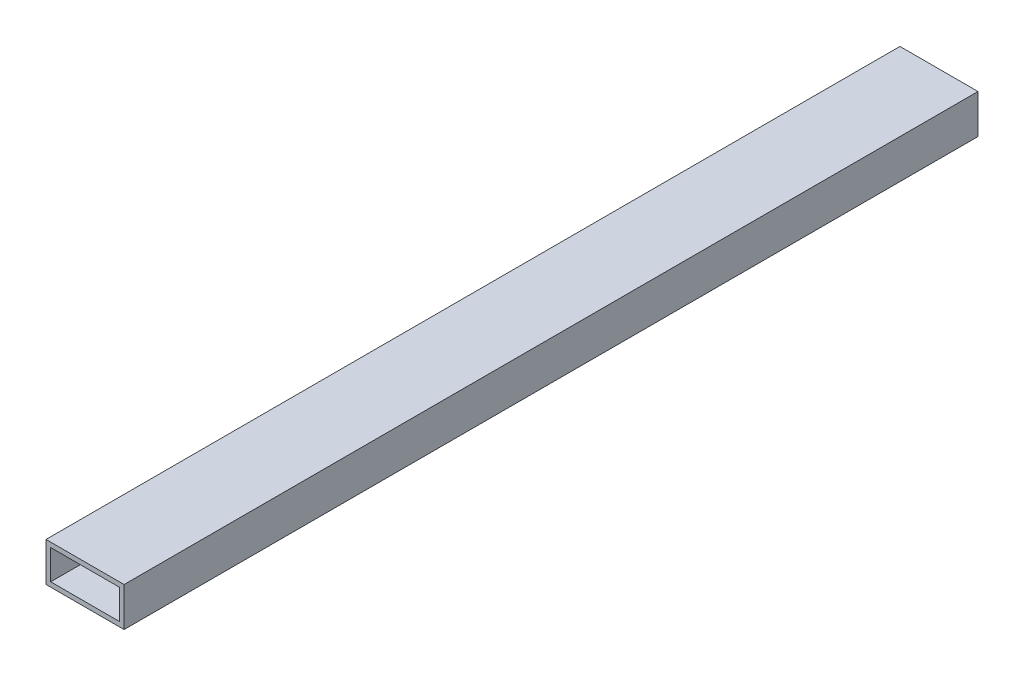
ISO-10303-21;
HEADER;
FILE_DESCRIPTION(('STEP AP214'),'2;1');
FILE_NAME('part.step','',(''),(''),'','','');
FILE_SCHEMA(('AUTOMOTIVE_DESIGN { 1 0 10303 214 1 1 1 1 }'));
ENDSEC;
DATA;
#1=APPLICATION_CONTEXT('core data for automotive mechanical design processes');
#2=APPLICATION_PROTOCOL_DEFINITION('international standard','automotive_design',2000,#1);
#3=PRODUCT_CONTEXT('',#1,'mechanical');
#4=PRODUCT('Part','Part','',(#3));
#5=PRODUCT_RELATED_PRODUCT_CATEGORY('part','',(#4));
#6=PRODUCT_DEFINITION_FORMATION('','',#4);
#7=PRODUCT_DEFINITION_CONTEXT('part definition',#1,'design');
#8=PRODUCT_DEFINITION('design','',#6,#7);
#9=PRODUCT_DEFINITION_SHAPE('','',#8);
#10=(LENGTH_UNIT() NAMED_UNIT(*) SI_UNIT(.MILLI.,.METRE.));
#11=(NAMED_UNIT(*) PLANE_ANGLE_UNIT() SI_UNIT($,.RADIAN.));
#12=(NAMED_UNIT(*) SI_UNIT($,.STERADIAN.) SOLID_ANGLE_UNIT());
#13=UNCERTAINTY_MEASURE_WITH_UNIT(LENGTH_MEASURE(1.E-05),#10,'distance_accuracy_value','');
#14=(GEOMETRIC_REPRESENTATION_CONTEXT(3) GLOBAL_UNCERTAINTY_ASSIGNED_CONTEXT((#13)) GLOBAL_UNIT_ASSIGNED_CONTEXT((#10,
#11,#12)) REPRESENTATION_CONTEXT('',''));
#15=CARTESIAN_POINT('',(0.,0.,0.));
#16=DIRECTION('',(0.,0.,1.));
#17=DIRECTION('',(1.,0.,0.));
#18=AXIS2_PLACEMENT_3D('',#15,#16,#17);
#19=CARTESIAN_POINT('',(0.,0.,558.8));
#20=DIRECTION('',(0.,0.,-1.));
#21=DIRECTION('',(-1.,0.,0.));
#22=AXIS2_PLACEMENT_3D('',#19,#20,#21);
#23=PLANE('',#22);
#24=DIRECTION('',(0.,-1.,0.));
#25=VECTOR('',#24,1.);
#26=CARTESIAN_POINT('',(0.,0.,558.8));
#27=LINE('',#26,#25);
#28=CARTESIAN_POINT('',(0.,25.4,558.8));
#29=VERTEX_POINT('',#28);
#30=CARTESIAN_POINT('',(0.,0.,558.8));
#31=VERTEX_POINT('',#30);
#32=EDGE_CURVE('E157',#29,#31,#27,.T.);
#33=ORIENTED_EDGE('',*,*,#32,.T.);
#34=DIRECTION('',(1.,0.,0.));
#35=VECTOR('',#34,1.);
#36=CARTESIAN_POINT('',(0.,0.,558.8));
#37=LINE('',#36,#35);
#38=CARTESIAN_POINT('',(50.8,0.,558.8));
#39=VERTEX_POINT('',#38);
#40=EDGE_CURVE('E161',#31,#39,#37,.T.);
#41=ORIENTED_EDGE('',*,*,#40,.T.);
#42=DIRECTION('',(0.,1.,0.));
#43=VECTOR('',#42,1.);
#44=CARTESIAN_POINT('',(50.8,0.,558.8));
#45=LINE('',#44,#43);
#46=CARTESIAN_POINT('',(50.8,25.4,558.8));
#47=VERTEX_POINT('',#46);
#48=EDGE_CURVE('E165',#39,#47,#45,.T.);
#49=ORIENTED_EDGE('',*,*,#48,.T.);
#50=DIRECTION('',(-1.,0.,0.));
#51=VECTOR('',#50,1.);
#52=CARTESIAN_POINT('',(0.,25.4,558.8));
#53=LINE('',#52,#51);
#54=EDGE_CURVE('E168',#47,#29,#53,.T.);
#55=ORIENTED_EDGE('',*,*,#54,.T.);
#56=EDGE_LOOP('',(#33,#41,#49,#55));
#57=FACE_BOUND('',#56,.T.);
#58=DIRECTION('',(1.,0.,0.));
#59=VECTOR('',#58,1.);
#60=CARTESIAN_POINT('',(3.048,3.048,558.8));
#61=LINE('',#60,#59);
#62=CARTESIAN_POINT('',(3.048,3.048,558.8));
#63=VERTEX_POINT('',#62);
#64=CARTESIAN_POINT('',(47.752,3.048,558.8));
#65=VERTEX_POINT('',#64);
#66=EDGE_CURVE('E109',#63,#65,#61,.T.);
#67=ORIENTED_EDGE('',*,*,#66,.F.);
#68=DIRECTION('',(0.,-1.,0.));
#69=VECTOR('',#68,1.);
#70=CARTESIAN_POINT('',(3.048,3.048,558.8));
#71=LINE('',#70,#69);
#72=CARTESIAN_POINT('',(3.048,22.352,558.8));
#73=VERTEX_POINT('',#72);
#74=EDGE_CURVE('E135',#73,#63,#71,.T.);
#75=ORIENTED_EDGE('',*,*,#74,.F.);
#76=DIRECTION('',(-1.,0.,0.));
#77=VECTOR('',#76,1.);
#78=CARTESIAN_POINT('',(3.048,22.352,558.8));
#79=LINE('',#78,#77);
#80=CARTESIAN_POINT('',(47.752,22.352,558.8));
#81=VERTEX_POINT('',#80);
#82=EDGE_CURVE('E131',#81,#73,#79,.T.);
#83=ORIENTED_EDGE('',*,*,#82,.F.);
#84=DIRECTION('',(0.,1.,0.));
#85=VECTOR('',#84,1.);
#86=CARTESIAN_POINT('',(47.752,3.048,558.8));
#87=LINE('',#86,#85);
#88=EDGE_CURVE('E118',#65,#81,#87,.T.);
#89=ORIENTED_EDGE('',*,*,#88,.F.);
#90=EDGE_LOOP('',(#67,#75,#83,#89));
#91=FACE_BOUND('',#90,.T.);
#92=ADVANCED_FACE('F43',(#57,#91),#23,.F.);
#93=CARTESIAN_POINT('',(0.,0.,3.175));
#94=DIRECTION('',(0.,0.,-1.));
#95=DIRECTION('',(-1.,0.,0.));
#96=AXIS2_PLACEMENT_3D('',#93,#94,#95);
#97=PLANE('',#96);
#98=DIRECTION('',(0.,-1.,0.));
#99=VECTOR('',#98,1.);
#100=CARTESIAN_POINT('',(0.,0.,3.175));
#101=LINE('',#100,#99);
#102=CARTESIAN_POINT('',(0.,25.4,3.175));
#103=VERTEX_POINT('',#102);
#104=CARTESIAN_POINT('',(0.,0.,3.175));
#105=VERTEX_POINT('',#104);
#106=EDGE_CURVE('E127',#103,#105,#101,.T.);
#107=ORIENTED_EDGE('',*,*,#106,.F.);
#108=DIRECTION('',(-1.,0.,0.));
#109=VECTOR('',#108,1.);
#110=CARTESIAN_POINT('',(0.,25.4,3.175));
#111=LINE('',#110,#109);
#112=CARTESIAN_POINT('',(50.8,25.4,3.175));
#113=VERTEX_POINT('',#112);
#114=EDGE_CURVE('E162',#113,#103,#111,.T.);
#115=ORIENTED_EDGE('',*,*,#114,.F.);
#116=DIRECTION('',(0.,1.,0.));
#117=VECTOR('',#116,1.);
#118=CARTESIAN_POINT('',(50.8,0.,3.175));
#119=LINE('',#118,#117);
#120=CARTESIAN_POINT('',(50.8,0.,3.175));
#121=VERTEX_POINT('',#120);
#122=EDGE_CURVE('E178',#121,#113,#119,.T.);
#123=ORIENTED_EDGE('',*,*,#122,.F.);
#124=DIRECTION('',(1.,0.,0.));
#125=VECTOR('',#124,1.);
#126=CARTESIAN_POINT('',(0.,0.,3.175));
#127=LINE('',#126,#125);
#128=EDGE_CURVE('E175',#105,#121,#127,.T.);
#129=ORIENTED_EDGE('',*,*,#128,.F.);
#130=EDGE_LOOP('',(#107,#115,#123,#129));
#131=FACE_BOUND('',#130,.T.);
#132=DIRECTION('',(0.,-1.,0.));
#133=VECTOR('',#132,1.);
#134=CARTESIAN_POINT('',(3.048,3.048,3.175));
#135=LINE('',#134,#133);
#136=CARTESIAN_POINT('',(3.048,22.352,3.175));
#137=VERTEX_POINT('',#136);
#138=CARTESIAN_POINT('',(3.048,3.048,3.175));
#139=VERTEX_POINT('',#138);
#140=EDGE_CURVE('E119',#137,#139,#135,.T.);
#141=ORIENTED_EDGE('',*,*,#140,.T.);
#142=DIRECTION('',(1.,0.,0.));
#143=VECTOR('',#142,1.);
#144=CARTESIAN_POINT('',(3.048,3.048,3.175));
#145=LINE('',#144,#143);
#146=CARTESIAN_POINT('',(47.752,3.048,3.175));
#147=VERTEX_POINT('',#146);
#148=EDGE_CURVE('E67',#139,#147,#145,.T.);
#149=ORIENTED_EDGE('',*,*,#148,.T.);
#150=DIRECTION('',(0.,1.,0.));
#151=VECTOR('',#150,1.);
#152=CARTESIAN_POINT('',(47.752,3.048,3.175));
#153=LINE('',#152,#151);
#154=CARTESIAN_POINT('',(47.752,22.352,3.175));
#155=VERTEX_POINT('',#154);
#156=EDGE_CURVE('E125',#147,#155,#153,.T.);
#157=ORIENTED_EDGE('',*,*,#156,.T.);
#158=DIRECTION('',(-1.,0.,0.));
#159=VECTOR('',#158,1.);
#160=CARTESIAN_POINT('',(3.048,22.352,3.175));
#161=LINE('',#160,#159);
#162=EDGE_CURVE('E144',#155,#137,#161,.T.);
#163=ORIENTED_EDGE('',*,*,#162,.T.);
#164=EDGE_LOOP('',(#141,#149,#157,#163));
#165=FACE_BOUND('',#164,.T.);
#166=ADVANCED_FACE('F201',(#131,#165),#97,.T.);
#167=CARTESIAN_POINT('',(0.,0.,558.8));
#168=DIRECTION('',(1.,0.,0.));
#169=DIRECTION('',(0.,1.,0.));
#170=AXIS2_PLACEMENT_3D('',#167,#168,#169);
#171=PLANE('',#170);
#172=ORIENTED_EDGE('',*,*,#106,.T.);
#173=DIRECTION('',(0.,0.,-1.));
#174=VECTOR('',#173,1.);
#175=CARTESIAN_POINT('',(0.,0.,558.8));
#176=LINE('',#175,#174);
#177=EDGE_CURVE('E11',#31,#105,#176,.T.);
#178=ORIENTED_EDGE('',*,*,#177,.F.);
#179=ORIENTED_EDGE('',*,*,#32,.F.);
#180=DIRECTION('',(0.,0.,-1.));
#181=VECTOR('',#180,1.);
#182=CARTESIAN_POINT('',(0.,25.4,558.8));
#183=LINE('',#182,#181);
#184=EDGE_CURVE('E171',#29,#103,#183,.T.);
#185=ORIENTED_EDGE('',*,*,#184,.T.);
#186=EDGE_LOOP('',(#172,#178,#179,#185));
#187=FACE_BOUND('',#186,.T.);
#188=ADVANCED_FACE('F45',(#187),#171,.F.);
#189=CARTESIAN_POINT('',(0.,0.,558.8));
#190=DIRECTION('',(0.,1.,0.));
#191=DIRECTION('',(0.,0.,1.));
#192=AXIS2_PLACEMENT_3D('',#189,#190,#191);
#193=PLANE('',#192);
#194=ORIENTED_EDGE('',*,*,#128,.T.);
#195=DIRECTION('',(0.,0.,-1.));
#196=VECTOR('',#195,1.);
#197=CARTESIAN_POINT('',(50.8,0.,558.8));
#198=LINE('',#197,#196);
#199=EDGE_CURVE('E52',#39,#121,#198,.T.);
#200=ORIENTED_EDGE('',*,*,#199,.F.);
#201=ORIENTED_EDGE('',*,*,#40,.F.);
#202=ORIENTED_EDGE('',*,*,#177,.T.);
#203=EDGE_LOOP('',(#194,#200,#201,#202));
#204=FACE_BOUND('',#203,.T.);
#205=ADVANCED_FACE('F211',(#204),#193,.F.);
#206=CARTESIAN_POINT('',(50.8,0.,558.8));
#207=DIRECTION('',(-1.,0.,0.));
#208=DIRECTION('',(0.,-1.,0.));
#209=AXIS2_PLACEMENT_3D('',#206,#207,#208);
#210=PLANE('',#209);
#211=ORIENTED_EDGE('',*,*,#122,.T.);
#212=DIRECTION('',(0.,0.,-1.));
#213=VECTOR('',#212,1.);
#214=CARTESIAN_POINT('',(50.8,25.4,558.8));
#215=LINE('',#214,#213);
#216=EDGE_CURVE('E186',#47,#113,#215,.T.);
#217=ORIENTED_EDGE('',*,*,#216,.F.);
#218=ORIENTED_EDGE('',*,*,#48,.F.);
#219=ORIENTED_EDGE('',*,*,#199,.T.);
#220=EDGE_LOOP('',(#211,#217,#218,#219));
#221=FACE_BOUND('',#220,.T.);
#222=ADVANCED_FACE('F195',(#221),#210,.F.);
#223=CARTESIAN_POINT('',(0.,25.4,558.8));
#224=DIRECTION('',(0.,-1.,0.));
#225=DIRECTION('',(0.,0.,-1.));
#226=AXIS2_PLACEMENT_3D('',#223,#224,#225);
#227=PLANE('',#226);
#228=ORIENTED_EDGE('',*,*,#114,.T.);
#229=ORIENTED_EDGE('',*,*,#184,.F.);
#230=ORIENTED_EDGE('',*,*,#54,.F.);
#231=ORIENTED_EDGE('',*,*,#216,.T.);
#232=EDGE_LOOP('',(#228,#229,#230,#231));
#233=FACE_BOUND('',#232,.T.);
#234=ADVANCED_FACE('F205',(#233),#227,.F.);
#235=CARTESIAN_POINT('',(3.048,3.048,558.8));
#236=DIRECTION('',(0.,1.,0.));
#237=DIRECTION('',(0.,0.,1.));
#238=AXIS2_PLACEMENT_3D('',#235,#236,#237);
#239=PLANE('',#238);
#240=ORIENTED_EDGE('',*,*,#148,.F.);
#241=DIRECTION('',(0.,0.,-1.));
#242=VECTOR('',#241,1.);
#243=CARTESIAN_POINT('',(3.048,3.048,558.8));
#244=LINE('',#243,#242);
#245=EDGE_CURVE('E113',#63,#139,#244,.T.);
#246=ORIENTED_EDGE('',*,*,#245,.F.);
#247=ORIENTED_EDGE('',*,*,#66,.T.);
#248=DIRECTION('',(0.,0.,-1.));
#249=VECTOR('',#248,1.);
#250=CARTESIAN_POINT('',(47.752,3.048,558.8));
#251=LINE('',#250,#249);
#252=EDGE_CURVE('E112',#65,#147,#251,.T.);
#253=ORIENTED_EDGE('',*,*,#252,.T.);
#254=EDGE_LOOP('',(#240,#246,#247,#253));
#255=FACE_BOUND('',#254,.T.);
#256=ADVANCED_FACE('F111',(#255),#239,.T.);
#257=CARTESIAN_POINT('',(47.752,3.048,558.8));
#258=DIRECTION('',(-1.,0.,0.));
#259=DIRECTION('',(0.,0.,1.));
#260=AXIS2_PLACEMENT_3D('',#257,#258,#259);
#261=PLANE('',#260);
#262=ORIENTED_EDGE('',*,*,#156,.F.);
#263=ORIENTED_EDGE('',*,*,#252,.F.);
#264=ORIENTED_EDGE('',*,*,#88,.T.);
#265=DIRECTION('',(0.,0.,-1.));
#266=VECTOR('',#265,1.);
#267=CARTESIAN_POINT('',(47.752,22.352,558.8));
#268=LINE('',#267,#266);
#269=EDGE_CURVE('E128',#81,#155,#268,.T.);
#270=ORIENTED_EDGE('',*,*,#269,.T.);
#271=EDGE_LOOP('',(#262,#263,#264,#270));
#272=FACE_BOUND('',#271,.T.);
#273=ADVANCED_FACE('F122',(#272),#261,.T.);
#274=CARTESIAN_POINT('',(3.048,22.352,558.8));
#275=DIRECTION('',(0.,-1.,0.));
#276=DIRECTION('',(0.,0.,-1.));
#277=AXIS2_PLACEMENT_3D('',#274,#275,#276);
#278=PLANE('',#277);
#279=ORIENTED_EDGE('',*,*,#162,.F.);
#280=ORIENTED_EDGE('',*,*,#269,.F.);
#281=ORIENTED_EDGE('',*,*,#82,.T.);
#282=DIRECTION('',(0.,0.,-1.));
#283=VECTOR('',#282,1.);
#284=CARTESIAN_POINT('',(3.048,22.352,558.8));
#285=LINE('',#284,#283);
#286=EDGE_CURVE('E59',#73,#137,#285,.T.);
#287=ORIENTED_EDGE('',*,*,#286,.T.);
#288=EDGE_LOOP('',(#279,#280,#281,#287));
#289=FACE_BOUND('',#288,.T.);
#290=ADVANCED_FACE('F234',(#289),#278,.T.);
#291=CARTESIAN_POINT('',(3.048,3.048,558.8));
#292=DIRECTION('',(1.,0.,0.));
#293=DIRECTION('',(0.,0.,-1.));
#294=AXIS2_PLACEMENT_3D('',#291,#292,#293);
#295=PLANE('',#294);
#296=ORIENTED_EDGE('',*,*,#140,.F.);
#297=ORIENTED_EDGE('',*,*,#286,.F.);
#298=ORIENTED_EDGE('',*,*,#74,.T.);
#299=ORIENTED_EDGE('',*,*,#245,.T.);
#300=EDGE_LOOP('',(#296,#297,#298,#299));
#301=FACE_BOUND('',#300,.T.);
#302=ADVANCED_FACE('F238',(#301),#295,.T.);
#303=CLOSED_SHELL('',(#92,#166,#188,#205,#222,#234,#256,#273,#290,#302));
#304=MANIFOLD_SOLID_BREP('B2',#303);
#305=ADVANCED_BREP_SHAPE_REPRESENTATION('',(#18,#304),#14);
#306=SHAPE_DEFINITION_REPRESENTATION(#9,#305);
ENDSEC;
END-ISO-10303-21;
